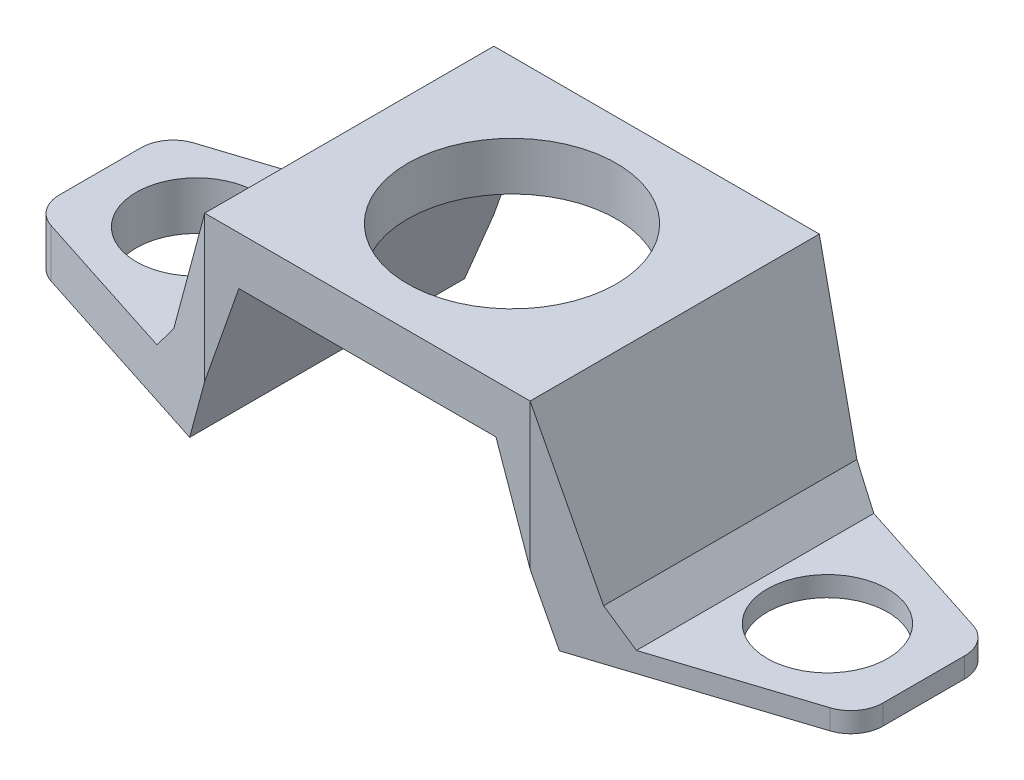
ISO-10303-21;
HEADER;
FILE_DESCRIPTION(('STEP AP214'),'2;1');
FILE_NAME('part.step','',(''),(''),'','','');
FILE_SCHEMA(('AUTOMOTIVE_DESIGN { 1 0 10303 214 1 1 1 1 }'));
ENDSEC;
DATA;
#1=APPLICATION_CONTEXT('core data for automotive mechanical design processes');
#2=APPLICATION_PROTOCOL_DEFINITION('international standard','automotive_design',2000,#1);
#3=PRODUCT_CONTEXT('',#1,'mechanical');
#4=PRODUCT('Part','Part','',(#3));
#5=PRODUCT_RELATED_PRODUCT_CATEGORY('part','',(#4));
#6=PRODUCT_DEFINITION_FORMATION('','',#4);
#7=PRODUCT_DEFINITION_CONTEXT('part definition',#1,'design');
#8=PRODUCT_DEFINITION('design','',#6,#7);
#9=PRODUCT_DEFINITION_SHAPE('','',#8);
#10=(LENGTH_UNIT() NAMED_UNIT(*) SI_UNIT(.MILLI.,.METRE.));
#11=(NAMED_UNIT(*) PLANE_ANGLE_UNIT() SI_UNIT($,.RADIAN.));
#12=(NAMED_UNIT(*) SI_UNIT($,.STERADIAN.) SOLID_ANGLE_UNIT());
#13=UNCERTAINTY_MEASURE_WITH_UNIT(LENGTH_MEASURE(1.E-05),#10,'distance_accuracy_value','');
#14=(GEOMETRIC_REPRESENTATION_CONTEXT(3) GLOBAL_UNCERTAINTY_ASSIGNED_CONTEXT((#13)) GLOBAL_UNIT_ASSIGNED_CONTEXT((#10,
#11,#12)) REPRESENTATION_CONTEXT('',''));
#15=CARTESIAN_POINT('',(0.,0.,0.));
#16=DIRECTION('',(0.,0.,1.));
#17=DIRECTION('',(1.,0.,0.));
#18=AXIS2_PLACEMENT_3D('',#15,#16,#17);
#19=CARTESIAN_POINT('',(-25.6335765484451,3.,9.));
#20=DIRECTION('',(1.,0.,0.));
#21=DIRECTION('',(0.,0.,-1.));
#22=AXIS2_PLACEMENT_3D('',#19,#20,#21);
#23=PLANE('',#22);
#24=DIRECTION('',(0.,0.,-1.));
#25=VECTOR('',#24,1.);
#26=CARTESIAN_POINT('',(-25.6335765484451,3.,9.));
#27=LINE('',#26,#25);
#28=CARTESIAN_POINT('',(-25.6335765484451,3.,2.54349252311762));
#29=VERTEX_POINT('',#28);
#30=CARTESIAN_POINT('',(-25.6335765484451,3.,-2.54349252311763));
#31=VERTEX_POINT('',#30);
#32=EDGE_CURVE('E210',#29,#31,#27,.T.);
#33=ORIENTED_EDGE('',*,*,#32,.T.);
#34=DIRECTION('',(0.,1.,0.));
#35=VECTOR('',#34,1.);
#36=CARTESIAN_POINT('',(-25.6335765484451,3.,-2.54349252311763));
#37=LINE('',#36,#35);
#38=CARTESIAN_POINT('',(-25.6335765484451,0.,-2.54349252311763));
#39=VERTEX_POINT('',#38);
#40=EDGE_CURVE('E291',#31,#39,#37,.F.);
#41=ORIENTED_EDGE('',*,*,#40,.T.);
#42=DIRECTION('',(0.,0.,-1.));
#43=VECTOR('',#42,1.);
#44=CARTESIAN_POINT('',(-25.6335765484451,0.,9.));
#45=LINE('',#44,#43);
#46=CARTESIAN_POINT('',(-25.6335765484451,0.,2.54349252311762));
#47=VERTEX_POINT('',#46);
#48=EDGE_CURVE('E247',#47,#39,#45,.T.);
#49=ORIENTED_EDGE('',*,*,#48,.F.);
#50=DIRECTION('',(0.,1.,0.));
#51=VECTOR('',#50,1.);
#52=CARTESIAN_POINT('',(-25.6335765484451,3.,2.54349252311762));
#53=LINE('',#52,#51);
#54=EDGE_CURVE('E288',#47,#29,#53,.T.);
#55=ORIENTED_EDGE('',*,*,#54,.T.);
#56=EDGE_LOOP('',(#33,#41,#49,#55));
#57=FACE_BOUND('',#56,.T.);
#58=ADVANCED_FACE('F44',(#57),#23,.F.);
#59=CARTESIAN_POINT('',(-25.6335765484451,0.,9.));
#60=DIRECTION('',(0.,1.,0.));
#61=DIRECTION('',(-1.,0.,0.));
#62=AXIS2_PLACEMENT_3D('',#59,#60,#61);
#63=PLANE('',#62);
#64=CARTESIAN_POINT('',(-19.6335765484451,0.,0.));
#65=DIRECTION('',(0.,1.,0.));
#66=DIRECTION('',(-1.,0.,0.));
#67=AXIS2_PLACEMENT_3D('',#64,#65,#66);
#68=CIRCLE('',#67,3.75);
#69=CARTESIAN_POINT('',(-19.6335765484451,0.,3.75));
#70=VERTEX_POINT('',#69);
#71=EDGE_CURVE('E333',#70,#70,#68,.F.);
#72=ORIENTED_EDGE('',*,*,#71,.F.);
#73=EDGE_LOOP('',(#72));
#74=FACE_BOUND('',#73,.T.);
#75=ORIENTED_EDGE('',*,*,#48,.T.);
#76=CARTESIAN_POINT('',(-23.6335765484451,0.,-2.54349252311763));
#77=DIRECTION('',(0.,1.,0.));
#78=DIRECTION('',(-1.,0.,0.));
#79=AXIS2_PLACEMENT_3D('',#76,#77,#78);
#80=CIRCLE('',#79,2.);
#81=CARTESIAN_POINT('',(-24.2473517188595,0.,-4.44698406241662));
#82=VERTEX_POINT('',#81);
#83=EDGE_CURVE('E295',#39,#82,#80,.F.);
#84=ORIENTED_EDGE('',*,*,#83,.T.);
#85=DIRECTION('',(0.951745769649497,0.,-0.306887585207168));
#86=VECTOR('',#85,1.);
#87=CARTESIAN_POINT('',(-29.4306030411705,0.,-2.77566013059427));
#88=LINE('',#87,#86);
#89=CARTESIAN_POINT('',(-11.5064234515549,0.,-8.55525838728262));
#90=VERTEX_POINT('',#89);
#91=EDGE_CURVE('E365',#82,#90,#88,.T.);
#92=ORIENTED_EDGE('',*,*,#91,.T.);
#93=DIRECTION('',(0.,0.,-1.));
#94=VECTOR('',#93,1.);
#95=CARTESIAN_POINT('',(-11.5064234515549,0.,9.));
#96=LINE('',#95,#94);
#97=CARTESIAN_POINT('',(-11.5064234515549,0.,8.55525838728262));
#98=VERTEX_POINT('',#97);
#99=EDGE_CURVE('E244',#98,#90,#96,.T.);
#100=ORIENTED_EDGE('',*,*,#99,.F.);
#101=DIRECTION('',(-0.951745769649497,0.,-0.306887585207168));
#102=VECTOR('',#101,1.);
#103=CARTESIAN_POINT('',(-24.1731817435508,0.,4.47089994977144));
#104=LINE('',#103,#102);
#105=CARTESIAN_POINT('',(-24.2473517188595,0.,4.44698406241662));
#106=VERTEX_POINT('',#105);
#107=EDGE_CURVE('E355',#98,#106,#104,.T.);
#108=ORIENTED_EDGE('',*,*,#107,.T.);
#109=CARTESIAN_POINT('',(-23.6335765484451,0.,2.54349252311762));
#110=DIRECTION('',(0.,1.,0.));
#111=DIRECTION('',(-1.,0.,0.));
#112=AXIS2_PLACEMENT_3D('',#109,#110,#111);
#113=CIRCLE('',#112,2.);
#114=EDGE_CURVE('E293',#106,#47,#113,.F.);
#115=ORIENTED_EDGE('',*,*,#114,.T.);
#116=EDGE_LOOP('',(#75,#84,#92,#100,#108,#115));
#117=FACE_BOUND('',#116,.T.);
#118=ADVANCED_FACE('F433',(#74,#117),#63,.F.);
#119=CARTESIAN_POINT('',(-11.5064234515549,0.,9.));
#120=DIRECTION('',(-0.943669198352679,0.330890380761382,0.));
#121=DIRECTION('',(-0.330890380761382,-0.943669198352679,0.));
#122=AXIS2_PLACEMENT_3D('',#119,#120,#121);
#123=PLANE('',#122);
#124=DIRECTION('',(0.330890380761382,0.943669198352679,0.));
#125=VECTOR('',#124,1.);
#126=CARTESIAN_POINT('',(-11.5064234515549,0.,9.));
#127=LINE('',#126,#125);
#128=CARTESIAN_POINT('',(-10.1271530968902,3.93355330216324,9.));
#129=VERTEX_POINT('',#128);
#130=CARTESIAN_POINT('',(-8.,10.,9.));
#131=VERTEX_POINT('',#130);
#132=EDGE_CURVE('E212',#129,#131,#127,.T.);
#133=ORIENTED_EDGE('',*,*,#132,.F.);
#134=DIRECTION('',(-0.329022924471758,-0.93834338327237,-0.106092460811382));
#135=VECTOR('',#134,1.);
#136=CARTESIAN_POINT('',(-11.4908989220258,0.0442745428314058,8.56026422553333));
#137=LINE('',#136,#135);
#138=EDGE_CURVE('E352',#129,#98,#137,.T.);
#139=ORIENTED_EDGE('',*,*,#138,.T.);
#140=ORIENTED_EDGE('',*,*,#99,.T.);
#141=DIRECTION('',(0.329022924471758,0.93834338327237,-0.106092460811382));
#142=VECTOR('',#141,1.);
#143=CARTESIAN_POINT('',(-12.119222252996,-1.74764631228258,-8.35766324119506));
#144=LINE('',#143,#142);
#145=CARTESIAN_POINT('',(-10.1271530968903,3.93355330216319,-9.));
#146=VERTEX_POINT('',#145);
#147=EDGE_CURVE('E362',#90,#146,#144,.T.);
#148=ORIENTED_EDGE('',*,*,#147,.T.);
#149=DIRECTION('',(0.330890380761382,0.943669198352679,0.));
#150=VECTOR('',#149,1.);
#151=CARTESIAN_POINT('',(-11.5064234515549,0.,-9.));
#152=LINE('',#151,#150);
#153=CARTESIAN_POINT('',(-8.,10.,-9.));
#154=VERTEX_POINT('',#153);
#155=EDGE_CURVE('E216',#146,#154,#152,.T.);
#156=ORIENTED_EDGE('',*,*,#155,.T.);
#157=DIRECTION('',(0.,0.,-1.));
#158=VECTOR('',#157,1.);
#159=CARTESIAN_POINT('',(-8.,10.,9.));
#160=LINE('',#159,#158);
#161=EDGE_CURVE('E241',#131,#154,#160,.T.);
#162=ORIENTED_EDGE('',*,*,#161,.F.);
#163=EDGE_LOOP('',(#133,#139,#140,#148,#156,#162));
#164=FACE_BOUND('',#163,.T.);
#165=ADVANCED_FACE('F375',(#164),#123,.F.);
#166=CARTESIAN_POINT('',(8.,9.99999999999999,9.));
#167=DIRECTION('',(0.,1.,0.));
#168=DIRECTION('',(0.,0.,1.));
#169=AXIS2_PLACEMENT_3D('',#166,#167,#168);
#170=PLANE('',#169);
#171=CARTESIAN_POINT('',(0.,9.99999999999999,0.));
#172=DIRECTION('',(0.,1.,0.));
#173=DIRECTION('',(0.,0.,1.));
#174=AXIS2_PLACEMENT_3D('',#171,#172,#173);
#175=CIRCLE('',#174,6.5);
#176=CARTESIAN_POINT('',(0.,9.99999999999999,6.5));
#177=VERTEX_POINT('',#176);
#178=EDGE_CURVE('E219',#177,#177,#175,.F.);
#179=ORIENTED_EDGE('',*,*,#178,.F.);
#180=EDGE_LOOP('',(#179));
#181=FACE_BOUND('',#180,.T.);
#182=DIRECTION('',(1.,0.,0.));
#183=VECTOR('',#182,1.);
#184=CARTESIAN_POINT('',(8.,9.99999999999999,-9.));
#185=LINE('',#184,#183);
#186=CARTESIAN_POINT('',(8.,9.99999999999999,-9.));
#187=VERTEX_POINT('',#186);
#188=EDGE_CURVE('E218',#154,#187,#185,.T.);
#189=ORIENTED_EDGE('',*,*,#188,.T.);
#190=DIRECTION('',(0.,0.,-1.));
#191=VECTOR('',#190,1.);
#192=CARTESIAN_POINT('',(8.,9.99999999999999,9.));
#193=LINE('',#192,#191);
#194=CARTESIAN_POINT('',(8.,9.99999999999999,9.));
#195=VERTEX_POINT('',#194);
#196=EDGE_CURVE('E239',#195,#187,#193,.T.);
#197=ORIENTED_EDGE('',*,*,#196,.F.);
#198=DIRECTION('',(1.,0.,0.));
#199=VECTOR('',#198,1.);
#200=CARTESIAN_POINT('',(-8.,10.,9.));
#201=LINE('',#200,#199);
#202=EDGE_CURVE('E206',#131,#195,#201,.T.);
#203=ORIENTED_EDGE('',*,*,#202,.F.);
#204=ORIENTED_EDGE('',*,*,#161,.T.);
#205=EDGE_LOOP('',(#189,#197,#203,#204));
#206=FACE_BOUND('',#205,.T.);
#207=ADVANCED_FACE('F379',(#181,#206),#170,.F.);
#208=CARTESIAN_POINT('',(11.5064234515549,0.,9.));
#209=DIRECTION('',(0.943669198352679,0.330890380761383,0.));
#210=DIRECTION('',(-0.330890380761383,0.943669198352679,0.));
#211=AXIS2_PLACEMENT_3D('',#208,#209,#210);
#212=PLANE('',#211);
#213=DIRECTION('',(0.,0.,-1.));
#214=VECTOR('',#213,1.);
#215=CARTESIAN_POINT('',(11.5064234515549,0.,9.));
#216=LINE('',#215,#214);
#217=CARTESIAN_POINT('',(11.5064234515549,0.,8.55525838728262));
#218=VERTEX_POINT('',#217);
#219=CARTESIAN_POINT('',(11.5064234515549,0.,-8.55525838728262));
#220=VERTEX_POINT('',#219);
#221=EDGE_CURVE('E200',#218,#220,#216,.T.);
#222=ORIENTED_EDGE('',*,*,#221,.F.);
#223=DIRECTION('',(-0.329022924471759,0.938343383272369,0.106092460811383));
#224=VECTOR('',#223,1.);
#225=CARTESIAN_POINT('',(11.4908989220258,0.044274542831406,8.56026422553333));
#226=LINE('',#225,#224);
#227=CARTESIAN_POINT('',(10.1271530968903,3.93355330216322,9.));
#228=VERTEX_POINT('',#227);
#229=EDGE_CURVE('E183',#218,#228,#226,.T.);
#230=ORIENTED_EDGE('',*,*,#229,.T.);
#231=DIRECTION('',(0.330890380761383,-0.943669198352679,0.));
#232=VECTOR('',#231,1.);
#233=CARTESIAN_POINT('',(11.5064234515549,0.,9.));
#234=LINE('',#233,#232);
#235=EDGE_CURVE('E198',#195,#228,#234,.T.);
#236=ORIENTED_EDGE('',*,*,#235,.F.);
#237=ORIENTED_EDGE('',*,*,#196,.T.);
#238=DIRECTION('',(0.330890380761383,-0.943669198352679,0.));
#239=VECTOR('',#238,1.);
#240=CARTESIAN_POINT('',(11.5064234515549,0.,-9.));
#241=LINE('',#240,#239);
#242=CARTESIAN_POINT('',(10.1271530968903,3.93355330216322,-9.));
#243=VERTEX_POINT('',#242);
#244=EDGE_CURVE('E221',#187,#243,#241,.T.);
#245=ORIENTED_EDGE('',*,*,#244,.T.);
#246=DIRECTION('',(0.329022924471759,-0.938343383272369,0.106092460811383));
#247=VECTOR('',#246,1.);
#248=CARTESIAN_POINT('',(12.119222252996,-1.74764631228259,-8.35766324119506));
#249=LINE('',#248,#247);
#250=EDGE_CURVE('E345',#243,#220,#249,.T.);
#251=ORIENTED_EDGE('',*,*,#250,.T.);
#252=EDGE_LOOP('',(#222,#230,#236,#237,#245,#251));
#253=FACE_BOUND('',#252,.T.);
#254=ADVANCED_FACE('F196',(#253),#212,.F.);
#255=CARTESIAN_POINT('',(25.6335765484451,0.,9.));
#256=DIRECTION('',(0.,1.,0.));
#257=DIRECTION('',(0.,0.,1.));
#258=AXIS2_PLACEMENT_3D('',#255,#256,#257);
#259=PLANE('',#258);
#260=CARTESIAN_POINT('',(19.6335765484451,0.,0.));
#261=DIRECTION('',(0.,1.,0.));
#262=DIRECTION('',(0.,0.,1.));
#263=AXIS2_PLACEMENT_3D('',#260,#261,#262);
#264=CIRCLE('',#263,3.75);
#265=CARTESIAN_POINT('',(19.6335765484451,0.,3.75));
#266=VERTEX_POINT('',#265);
#267=EDGE_CURVE('E327',#266,#266,#264,.F.);
#268=ORIENTED_EDGE('',*,*,#267,.F.);
#269=EDGE_LOOP('',(#268));
#270=FACE_BOUND('',#269,.T.);
#271=DIRECTION('',(0.951745769649497,0.,0.306887585207168));
#272=VECTOR('',#271,1.);
#273=CARTESIAN_POINT('',(29.4306030411705,0.,-2.77566013059427));
#274=LINE('',#273,#272);
#275=CARTESIAN_POINT('',(24.2473517188595,0.,-4.44698406241662));
#276=VERTEX_POINT('',#275);
#277=EDGE_CURVE('E342',#220,#276,#274,.T.);
#278=ORIENTED_EDGE('',*,*,#277,.T.);
#279=CARTESIAN_POINT('',(23.6335765484451,0.,-2.54349252311763));
#280=DIRECTION('',(0.,1.,0.));
#281=DIRECTION('',(0.,0.,1.));
#282=AXIS2_PLACEMENT_3D('',#279,#280,#281);
#283=CIRCLE('',#282,2.);
#284=CARTESIAN_POINT('',(25.6335765484451,0.,-2.54349252311763));
#285=VERTEX_POINT('',#284);
#286=EDGE_CURVE('E276',#276,#285,#283,.F.);
#287=ORIENTED_EDGE('',*,*,#286,.T.);
#288=DIRECTION('',(0.,0.,-1.));
#289=VECTOR('',#288,1.);
#290=CARTESIAN_POINT('',(25.6335765484451,0.,9.));
#291=LINE('',#290,#289);
#292=CARTESIAN_POINT('',(25.6335765484451,0.,2.54349252311763));
#293=VERTEX_POINT('',#292);
#294=EDGE_CURVE('E235',#293,#285,#291,.T.);
#295=ORIENTED_EDGE('',*,*,#294,.F.);
#296=CARTESIAN_POINT('',(23.6335765484451,0.,2.54349252311763));
#297=DIRECTION('',(0.,1.,0.));
#298=DIRECTION('',(0.,0.,1.));
#299=AXIS2_PLACEMENT_3D('',#296,#297,#298);
#300=CIRCLE('',#299,2.);
#301=CARTESIAN_POINT('',(24.2473517188595,0.,4.44698406241662));
#302=VERTEX_POINT('',#301);
#303=EDGE_CURVE('E274',#293,#302,#300,.F.);
#304=ORIENTED_EDGE('',*,*,#303,.T.);
#305=DIRECTION('',(-0.951745769649497,0.,0.306887585207168));
#306=VECTOR('',#305,1.);
#307=CARTESIAN_POINT('',(24.1731817435508,0.,4.47089994977144));
#308=LINE('',#307,#306);
#309=EDGE_CURVE('E202',#302,#218,#308,.T.);
#310=ORIENTED_EDGE('',*,*,#309,.T.);
#311=ORIENTED_EDGE('',*,*,#221,.T.);
#312=EDGE_LOOP('',(#278,#287,#295,#304,#310,#311));
#313=FACE_BOUND('',#312,.T.);
#314=ADVANCED_FACE('F387',(#270,#313),#259,.F.);
#315=CARTESIAN_POINT('',(25.6335765484451,3.,9.));
#316=DIRECTION('',(-1.,0.,0.));
#317=DIRECTION('',(0.,-1.,0.));
#318=AXIS2_PLACEMENT_3D('',#315,#316,#317);
#319=PLANE('',#318);
#320=ORIENTED_EDGE('',*,*,#294,.T.);
#321=DIRECTION('',(0.,1.,0.));
#322=VECTOR('',#321,1.);
#323=CARTESIAN_POINT('',(25.6335765484451,2.99999999999999,-2.54349252311763));
#324=LINE('',#323,#322);
#325=CARTESIAN_POINT('',(25.6335765484451,1.25,-2.54349252311763));
#326=VERTEX_POINT('',#325);
#327=EDGE_CURVE('E264',#285,#326,#324,.T.);
#328=ORIENTED_EDGE('',*,*,#327,.T.);
#329=DIRECTION('',(0.,0.,1.));
#330=VECTOR('',#329,1.);
#331=CARTESIAN_POINT('',(25.6335765484451,1.25,-10.));
#332=LINE('',#331,#330);
#333=CARTESIAN_POINT('',(25.6335765484451,1.25,2.54349252311763));
#334=VERTEX_POINT('',#333);
#335=EDGE_CURVE('E262',#326,#334,#332,.T.);
#336=ORIENTED_EDGE('',*,*,#335,.T.);
#337=DIRECTION('',(0.,1.,0.));
#338=VECTOR('',#337,1.);
#339=CARTESIAN_POINT('',(25.6335765484451,3.,2.54349252311763));
#340=LINE('',#339,#338);
#341=EDGE_CURVE('E191',#334,#293,#340,.F.);
#342=ORIENTED_EDGE('',*,*,#341,.T.);
#343=EDGE_LOOP('',(#320,#328,#336,#342));
#344=FACE_BOUND('',#343,.T.);
#345=ADVANCED_FACE('F394',(#344),#319,.F.);
#346=CARTESIAN_POINT('',(13.6335765484451,3.,9.));
#347=DIRECTION('',(-0.943669198352679,-0.330890380761383,0.));
#348=DIRECTION('',(0.330890380761383,-0.943669198352679,0.));
#349=AXIS2_PLACEMENT_3D('',#346,#347,#348);
#350=PLANE('',#349);
#351=DIRECTION('',(0.329022924471759,-0.938343383272369,-0.106092460811383));
#352=VECTOR('',#351,1.);
#353=CARTESIAN_POINT('',(13.5941096127345,3.11255610241015,7.88209021033261));
#354=LINE('',#353,#352);
#355=CARTESIAN_POINT('',(10.1271530968903,13.,9.));
#356=VERTEX_POINT('',#355);
#357=CARTESIAN_POINT('',(13.5854198909445,3.13733839670535,7.88489218521004));
#358=VERTEX_POINT('',#357);
#359=EDGE_CURVE('E186',#356,#358,#354,.T.);
#360=ORIENTED_EDGE('',*,*,#359,.T.);
#361=DIRECTION('',(0.,0.,-1.));
#362=VECTOR('',#361,1.);
#363=CARTESIAN_POINT('',(13.5854198909445,3.13733839670535,-7.67150295216404));
#364=LINE('',#363,#362);
#365=CARTESIAN_POINT('',(13.5854198909445,3.13733839670535,-7.88489218521004));
#366=VERTEX_POINT('',#365);
#367=EDGE_CURVE('E302',#358,#366,#364,.T.);
#368=ORIENTED_EDGE('',*,*,#367,.T.);
#369=DIRECTION('',(-0.329022924471759,0.938343383272369,-0.106092460811383));
#370=VECTOR('',#369,1.);
#371=CARTESIAN_POINT('',(14.2224329437047,1.32063524729615,-7.67948922599434));
#372=LINE('',#371,#370);
#373=CARTESIAN_POINT('',(10.1271530968903,13.,-9.));
#374=VERTEX_POINT('',#373);
#375=EDGE_CURVE('E201',#366,#374,#372,.T.);
#376=ORIENTED_EDGE('',*,*,#375,.T.);
#377=DIRECTION('',(0.,0.,-1.));
#378=VECTOR('',#377,1.);
#379=CARTESIAN_POINT('',(10.1271530968903,13.,9.));
#380=LINE('',#379,#378);
#381=EDGE_CURVE('E232',#356,#374,#380,.T.);
#382=ORIENTED_EDGE('',*,*,#381,.F.);
#383=EDGE_LOOP('',(#360,#368,#376,#382));
#384=FACE_BOUND('',#383,.T.);
#385=ADVANCED_FACE('F331',(#384),#350,.F.);
#386=CARTESIAN_POINT('',(-10.1271530968903,13.,9.));
#387=DIRECTION('',(0.,-1.,0.));
#388=DIRECTION('',(1.,0.,0.));
#389=AXIS2_PLACEMENT_3D('',#386,#387,#388);
#390=PLANE('',#389);
#391=CARTESIAN_POINT('',(0.,13.,0.));
#392=DIRECTION('',(0.,1.,0.));
#393=DIRECTION('',(-1.,0.,0.));
#394=AXIS2_PLACEMENT_3D('',#391,#392,#393);
#395=CIRCLE('',#394,6.5);
#396=CARTESIAN_POINT('',(-6.49999999999999,13.,0.));
#397=VERTEX_POINT('',#396);
#398=EDGE_CURVE('E367',#397,#397,#395,.T.);
#399=ORIENTED_EDGE('',*,*,#398,.F.);
#400=EDGE_LOOP('',(#399));
#401=FACE_BOUND('',#400,.T.);
#402=DIRECTION('',(-1.,0.,0.));
#403=VECTOR('',#402,1.);
#404=CARTESIAN_POINT('',(-10.1271530968903,13.,-9.));
#405=LINE('',#404,#403);
#406=CARTESIAN_POINT('',(-10.1271530968903,13.,-9.));
#407=VERTEX_POINT('',#406);
#408=EDGE_CURVE('E224',#374,#407,#405,.T.);
#409=ORIENTED_EDGE('',*,*,#408,.T.);
#410=DIRECTION('',(0.,0.,-1.));
#411=VECTOR('',#410,1.);
#412=CARTESIAN_POINT('',(-10.1271530968903,13.,9.));
#413=LINE('',#412,#411);
#414=CARTESIAN_POINT('',(-10.1271530968902,13.,9.));
#415=VERTEX_POINT('',#414);
#416=EDGE_CURVE('E229',#415,#407,#413,.T.);
#417=ORIENTED_EDGE('',*,*,#416,.F.);
#418=DIRECTION('',(-1.,0.,0.));
#419=VECTOR('',#418,1.);
#420=CARTESIAN_POINT('',(10.1271530968903,13.,9.));
#421=LINE('',#420,#419);
#422=EDGE_CURVE('E208',#356,#415,#421,.T.);
#423=ORIENTED_EDGE('',*,*,#422,.F.);
#424=ORIENTED_EDGE('',*,*,#381,.T.);
#425=EDGE_LOOP('',(#409,#417,#423,#424));
#426=FACE_BOUND('',#425,.T.);
#427=ADVANCED_FACE('F421',(#401,#426),#390,.F.);
#428=CARTESIAN_POINT('',(-13.6335765484451,3.,9.));
#429=DIRECTION('',(0.943669198352679,-0.330890380761382,0.));
#430=DIRECTION('',(0.330890380761383,0.943669198352679,0.));
#431=AXIS2_PLACEMENT_3D('',#428,#429,#430);
#432=PLANE('',#431);
#433=DIRECTION('',(-0.329022924471758,-0.93834338327237,0.106092460811382));
#434=VECTOR('',#433,1.);
#435=CARTESIAN_POINT('',(-14.2224329437047,1.32063524729616,-7.67948922599435));
#436=LINE('',#435,#434);
#437=CARTESIAN_POINT('',(-12.9717957869224,4.88733839670532,-8.08275344765369));
#438=VERTEX_POINT('',#437);
#439=EDGE_CURVE('E360',#407,#438,#436,.T.);
#440=ORIENTED_EDGE('',*,*,#439,.T.);
#441=DIRECTION('',(0.,0.,1.));
#442=VECTOR('',#441,1.);
#443=CARTESIAN_POINT('',(-12.9717957869224,4.88733839670532,7.86936421460769));
#444=LINE('',#443,#442);
#445=CARTESIAN_POINT('',(-12.9717957869224,4.88733839670532,8.08275344765369));
#446=VERTEX_POINT('',#445);
#447=EDGE_CURVE('E65',#438,#446,#444,.T.);
#448=ORIENTED_EDGE('',*,*,#447,.T.);
#449=DIRECTION('',(0.329022924471758,0.938343383272369,0.106092460811382));
#450=VECTOR('',#449,1.);
#451=CARTESIAN_POINT('',(-13.5941096127345,3.11255610241015,7.88209021033261));
#452=LINE('',#451,#450);
#453=EDGE_CURVE('E350',#446,#415,#452,.T.);
#454=ORIENTED_EDGE('',*,*,#453,.T.);
#455=ORIENTED_EDGE('',*,*,#416,.T.);
#456=EDGE_LOOP('',(#440,#448,#454,#455));
#457=FACE_BOUND('',#456,.T.);
#458=ADVANCED_FACE('F409',(#457),#432,.F.);
#459=CARTESIAN_POINT('',(-25.6335765484451,3.,9.));
#460=DIRECTION('',(0.,-1.,0.));
#461=DIRECTION('',(0.,0.,-1.));
#462=AXIS2_PLACEMENT_3D('',#459,#460,#461);
#463=PLANE('',#462);
#464=CARTESIAN_POINT('',(-19.6335765484451,3.,0.));
#465=DIRECTION('',(0.,1.,0.));
#466=DIRECTION('',(0.,0.,1.));
#467=AXIS2_PLACEMENT_3D('',#464,#465,#466);
#468=CIRCLE('',#467,3.75);
#469=CARTESIAN_POINT('',(-19.6335765484451,3.,3.75));
#470=VERTEX_POINT('',#469);
#471=EDGE_CURVE('E337',#470,#470,#468,.T.);
#472=ORIENTED_EDGE('',*,*,#471,.F.);
#473=EDGE_LOOP('',(#472));
#474=FACE_BOUND('',#473,.T.);
#475=DIRECTION('',(0.951745769649497,0.,0.306887585207168));
#476=VECTOR('',#475,1.);
#477=CARTESIAN_POINT('',(-24.1731817435508,3.,4.47089994977143));
#478=LINE('',#477,#476);
#479=CARTESIAN_POINT('',(-24.2473517188595,3.,4.44698406241662));
#480=VERTEX_POINT('',#479);
#481=CARTESIAN_POINT('',(-14.517820432236,3.,7.58424241119718));
#482=VERTEX_POINT('',#481);
#483=EDGE_CURVE('E347',#480,#482,#478,.T.);
#484=ORIENTED_EDGE('',*,*,#483,.T.);
#485=DIRECTION('',(0.,0.,-1.));
#486=VECTOR('',#485,1.);
#487=CARTESIAN_POINT('',(-14.517820432236,3.,-7.8693642146077));
#488=LINE('',#487,#486);
#489=CARTESIAN_POINT('',(-14.517820432236,3.,-7.58424241119718));
#490=VERTEX_POINT('',#489);
#491=EDGE_CURVE('E304',#482,#490,#488,.T.);
#492=ORIENTED_EDGE('',*,*,#491,.T.);
#493=DIRECTION('',(-0.951745769649497,0.,0.306887585207168));
#494=VECTOR('',#493,1.);
#495=CARTESIAN_POINT('',(-29.4306030411705,3.,-2.77566013059427));
#496=LINE('',#495,#494);
#497=CARTESIAN_POINT('',(-24.2473517188595,3.,-4.44698406241662));
#498=VERTEX_POINT('',#497);
#499=EDGE_CURVE('E358',#490,#498,#496,.T.);
#500=ORIENTED_EDGE('',*,*,#499,.T.);
#501=CARTESIAN_POINT('',(-23.6335765484451,3.,-2.54349252311763));
#502=DIRECTION('',(0.,-1.,0.));
#503=DIRECTION('',(0.,0.,-1.));
#504=AXIS2_PLACEMENT_3D('',#501,#502,#503);
#505=CIRCLE('',#504,2.);
#506=EDGE_CURVE('E286',#498,#31,#505,.F.);
#507=ORIENTED_EDGE('',*,*,#506,.T.);
#508=ORIENTED_EDGE('',*,*,#32,.F.);
#509=CARTESIAN_POINT('',(-23.6335765484451,3.,2.54349252311762));
#510=DIRECTION('',(0.,-1.,0.));
#511=DIRECTION('',(0.,0.,-1.));
#512=AXIS2_PLACEMENT_3D('',#509,#510,#511);
#513=CIRCLE('',#512,2.);
#514=EDGE_CURVE('E284',#29,#480,#513,.F.);
#515=ORIENTED_EDGE('',*,*,#514,.T.);
#516=EDGE_LOOP('',(#484,#492,#500,#507,#508,#515));
#517=FACE_BOUND('',#516,.T.);
#518=ADVANCED_FACE('F406',(#474,#517),#463,.F.);
#519=CARTESIAN_POINT('',(0.,0.,9.));
#520=DIRECTION('',(0.,0.,1.));
#521=DIRECTION('',(1.,0.,0.));
#522=AXIS2_PLACEMENT_3D('',#519,#520,#521);
#523=PLANE('',#522);
#524=DIRECTION('',(0.,-1.,0.));
#525=VECTOR('',#524,1.);
#526=CARTESIAN_POINT('',(10.1271530968903,0.,9.));
#527=LINE('',#526,#525);
#528=EDGE_CURVE('E179',#356,#228,#527,.T.);
#529=ORIENTED_EDGE('',*,*,#528,.F.);
#530=ORIENTED_EDGE('',*,*,#422,.T.);
#531=DIRECTION('',(0.,1.,0.));
#532=VECTOR('',#531,1.);
#533=CARTESIAN_POINT('',(-10.1271530968902,0.,9.));
#534=LINE('',#533,#532);
#535=EDGE_CURVE('E253',#129,#415,#534,.T.);
#536=ORIENTED_EDGE('',*,*,#535,.F.);
#537=ORIENTED_EDGE('',*,*,#132,.T.);
#538=ORIENTED_EDGE('',*,*,#202,.T.);
#539=ORIENTED_EDGE('',*,*,#235,.T.);
#540=EDGE_LOOP('',(#529,#530,#536,#537,#538,#539));
#541=FACE_BOUND('',#540,.T.);
#542=ADVANCED_FACE('F204',(#541),#523,.T.);
#543=CARTESIAN_POINT('',(0.,0.,-9.));
#544=DIRECTION('',(0.,0.,1.));
#545=DIRECTION('',(1.,0.,0.));
#546=AXIS2_PLACEMENT_3D('',#543,#544,#545);
#547=PLANE('',#546);
#548=ORIENTED_EDGE('',*,*,#408,.F.);
#549=DIRECTION('',(0.,-1.,0.));
#550=VECTOR('',#549,1.);
#551=CARTESIAN_POINT('',(10.1271530968903,0.,-9.));
#552=LINE('',#551,#550);
#553=EDGE_CURVE('E192',#374,#243,#552,.T.);
#554=ORIENTED_EDGE('',*,*,#553,.T.);
#555=ORIENTED_EDGE('',*,*,#244,.F.);
#556=ORIENTED_EDGE('',*,*,#188,.F.);
#557=ORIENTED_EDGE('',*,*,#155,.F.);
#558=DIRECTION('',(0.,1.,0.));
#559=VECTOR('',#558,1.);
#560=CARTESIAN_POINT('',(-10.1271530968903,0.,-9.));
#561=LINE('',#560,#559);
#562=EDGE_CURVE('E250',#146,#407,#561,.T.);
#563=ORIENTED_EDGE('',*,*,#562,.T.);
#564=EDGE_LOOP('',(#548,#554,#555,#556,#557,#563));
#565=FACE_BOUND('',#564,.T.);
#566=ADVANCED_FACE('F383',(#565),#547,.F.);
#567=CARTESIAN_POINT('',(0.,-0.00100000000001835,0.));
#568=DIRECTION('',(0.,1.,0.));
#569=DIRECTION('',(-1.,0.,0.));
#570=AXIS2_PLACEMENT_3D('',#567,#568,#569);
#571=CYLINDRICAL_SURFACE('',#570,6.5);
#572=ORIENTED_EDGE('',*,*,#398,.T.);
#573=EDGE_LOOP('',(#572));
#574=FACE_BOUND('',#573,.T.);
#575=ORIENTED_EDGE('',*,*,#178,.T.);
#576=EDGE_LOOP('',(#575));
#577=FACE_BOUND('',#576,.T.);
#578=ADVANCED_FACE('F516',(#574,#577),#571,.F.);
#579=CARTESIAN_POINT('',(-10.1271530968903,-5.,-9.));
#580=DIRECTION('',(0.306887585207168,0.,0.951745769649497));
#581=DIRECTION('',(0.951745769649497,0.,-0.306887585207168));
#582=AXIS2_PLACEMENT_3D('',#579,#580,#581);
#583=PLANE('',#582);
#584=ORIENTED_EDGE('',*,*,#91,.F.);
#585=DIRECTION('',(0.,1.,0.));
#586=VECTOR('',#585,1.);
#587=CARTESIAN_POINT('',(-24.2473517188595,-5.,-4.44698406241662));
#588=LINE('',#587,#586);
#589=EDGE_CURVE('E281',#82,#498,#588,.T.);
#590=ORIENTED_EDGE('',*,*,#589,.T.);
#591=ORIENTED_EDGE('',*,*,#499,.F.);
#592=DIRECTION('',(-0.620860803943776,-0.757927396464441,0.200194714752717));
#593=VECTOR('',#592,1.);
#594=CARTESIAN_POINT('',(-16.4139285410941,0.685290691193199,-6.97284800591027));
#595=LINE('',#594,#593);
#596=EDGE_CURVE('E52',#490,#438,#595,.F.);
#597=ORIENTED_EDGE('',*,*,#596,.T.);
#598=ORIENTED_EDGE('',*,*,#439,.F.);
#599=ORIENTED_EDGE('',*,*,#562,.F.);
#600=ORIENTED_EDGE('',*,*,#147,.F.);
#601=EDGE_LOOP('',(#584,#590,#591,#597,#598,#599,#600));
#602=FACE_BOUND('',#601,.T.);
#603=ADVANCED_FACE('F507',(#602),#583,.F.);
#604=CARTESIAN_POINT('',(-10.1271530968903,-5.,9.));
#605=DIRECTION('',(0.306887585207168,0.,-0.951745769649497));
#606=DIRECTION('',(-0.951745769649497,0.,-0.306887585207168));
#607=AXIS2_PLACEMENT_3D('',#604,#605,#606);
#608=PLANE('',#607);
#609=ORIENTED_EDGE('',*,*,#483,.F.);
#610=DIRECTION('',(0.,1.,0.));
#611=VECTOR('',#610,1.);
#612=CARTESIAN_POINT('',(-24.2473517188595,-5.,4.44698406241662));
#613=LINE('',#612,#611);
#614=EDGE_CURVE('E297',#480,#106,#613,.F.);
#615=ORIENTED_EDGE('',*,*,#614,.T.);
#616=ORIENTED_EDGE('',*,*,#107,.F.);
#617=ORIENTED_EDGE('',*,*,#138,.F.);
#618=ORIENTED_EDGE('',*,*,#535,.T.);
#619=ORIENTED_EDGE('',*,*,#453,.F.);
#620=DIRECTION('',(0.620860803943776,0.757927396464441,0.200194714752717));
#621=VECTOR('',#620,1.);
#622=CARTESIAN_POINT('',(-16.4139285410941,0.685290691193207,6.97284800591027));
#623=LINE('',#622,#621);
#624=EDGE_CURVE('E13',#446,#482,#623,.F.);
#625=ORIENTED_EDGE('',*,*,#624,.T.);
#626=EDGE_LOOP('',(#609,#615,#616,#617,#618,#619,#625));
#627=FACE_BOUND('',#626,.T.);
#628=ADVANCED_FACE('F418',(#627),#608,.F.);
#629=CARTESIAN_POINT('',(10.1271530968902,-5.00000000000001,-9.));
#630=DIRECTION('',(-0.306887585207168,0.,0.951745769649497));
#631=DIRECTION('',(0.951745769649497,0.,0.306887585207168));
#632=AXIS2_PLACEMENT_3D('',#629,#630,#631);
#633=PLANE('',#632);
#634=ORIENTED_EDGE('',*,*,#375,.F.);
#635=DIRECTION('',(-0.620860803943777,0.75792739646444,-0.200194714752718));
#636=VECTOR('',#635,1.);
#637=CARTESIAN_POINT('',(15.9429343520675,0.25935868483411,-7.12471867760257));
#638=LINE('',#637,#636);
#639=CARTESIAN_POINT('',(15.1314445362581,1.25,-7.38638114875352));
#640=VERTEX_POINT('',#639);
#641=EDGE_CURVE('E310',#366,#640,#638,.F.);
#642=ORIENTED_EDGE('',*,*,#641,.T.);
#643=DIRECTION('',(0.951745769649497,0.,0.306887585207168));
#644=VECTOR('',#643,1.);
#645=CARTESIAN_POINT('',(10.1271530968902,1.25,-9.));
#646=LINE('',#645,#644);
#647=CARTESIAN_POINT('',(24.2473517188595,1.25,-4.44698406241662));
#648=VERTEX_POINT('',#647);
#649=EDGE_CURVE('E316',#640,#648,#646,.T.);
#650=ORIENTED_EDGE('',*,*,#649,.T.);
#651=DIRECTION('',(0.,1.,0.));
#652=VECTOR('',#651,1.);
#653=CARTESIAN_POINT('',(24.2473517188595,-4.99999999999999,-4.44698406241662));
#654=LINE('',#653,#652);
#655=EDGE_CURVE('E272',#648,#276,#654,.F.);
#656=ORIENTED_EDGE('',*,*,#655,.T.);
#657=ORIENTED_EDGE('',*,*,#277,.F.);
#658=ORIENTED_EDGE('',*,*,#250,.F.);
#659=ORIENTED_EDGE('',*,*,#553,.F.);
#660=EDGE_LOOP('',(#634,#642,#650,#656,#657,#658,#659));
#661=FACE_BOUND('',#660,.T.);
#662=ADVANCED_FACE('F315',(#661),#633,.F.);
#663=CARTESIAN_POINT('',(10.1271530968902,-5.00000000000001,9.));
#664=DIRECTION('',(-0.306887585207168,0.,-0.951745769649497));
#665=DIRECTION('',(-0.951745769649497,0.,0.306887585207168));
#666=AXIS2_PLACEMENT_3D('',#663,#664,#665);
#667=PLANE('',#666);
#668=ORIENTED_EDGE('',*,*,#309,.F.);
#669=DIRECTION('',(0.,1.,0.));
#670=VECTOR('',#669,1.);
#671=CARTESIAN_POINT('',(24.2473517188595,-4.99999999999999,4.44698406241662));
#672=LINE('',#671,#670);
#673=CARTESIAN_POINT('',(24.2473517188595,1.25,4.44698406241662));
#674=VERTEX_POINT('',#673);
#675=EDGE_CURVE('E278',#302,#674,#672,.T.);
#676=ORIENTED_EDGE('',*,*,#675,.T.);
#677=DIRECTION('',(-0.951745769649497,0.,0.306887585207168));
#678=VECTOR('',#677,1.);
#679=CARTESIAN_POINT('',(10.1271530968902,1.25,9.));
#680=LINE('',#679,#678);
#681=CARTESIAN_POINT('',(15.1314445362581,1.25,7.38638114875352));
#682=VERTEX_POINT('',#681);
#683=EDGE_CURVE('E261',#674,#682,#680,.T.);
#684=ORIENTED_EDGE('',*,*,#683,.T.);
#685=DIRECTION('',(0.620860803943777,-0.75792739646444,-0.200194714752718));
#686=VECTOR('',#685,1.);
#687=CARTESIAN_POINT('',(15.9429343520675,0.25935868483411,7.12471867760257));
#688=LINE('',#687,#686);
#689=EDGE_CURVE('E308',#682,#358,#688,.F.);
#690=ORIENTED_EDGE('',*,*,#689,.T.);
#691=ORIENTED_EDGE('',*,*,#359,.F.);
#692=ORIENTED_EDGE('',*,*,#528,.T.);
#693=ORIENTED_EDGE('',*,*,#229,.F.);
#694=EDGE_LOOP('',(#668,#676,#684,#690,#691,#692,#693));
#695=FACE_BOUND('',#694,.T.);
#696=ADVANCED_FACE('F182',(#695),#667,.F.);
#697=CARTESIAN_POINT('',(-19.6335765484451,-0.00100000000000013,0.));
#698=DIRECTION('',(0.,1.,0.));
#699=DIRECTION('',(0.,0.,1.));
#700=AXIS2_PLACEMENT_3D('',#697,#698,#699);
#701=CYLINDRICAL_SURFACE('',#700,3.75);
#702=CARTESIAN_POINT('',(-19.6335765484451,3.,3.75));
#703=CARTESIAN_POINT('',(-19.6335765484451,2.96875,3.75));
#704=CARTESIAN_POINT('',(-19.6335765484451,2.9375,3.75));
#705=CARTESIAN_POINT('',(-19.6335765484451,2.875,3.75));
#706=CARTESIAN_POINT('',(-19.6335765484451,2.84375,3.75));
#707=CARTESIAN_POINT('',(-19.6335765484451,2.78125,3.75));
#708=CARTESIAN_POINT('',(-19.6335765484451,2.75,3.75));
#709=CARTESIAN_POINT('',(-19.6335765484451,2.6875,3.75));
#710=CARTESIAN_POINT('',(-19.6335765484451,2.65625,3.75));
#711=CARTESIAN_POINT('',(-19.6335765484451,2.59375,3.75));
#712=CARTESIAN_POINT('',(-19.6335765484451,2.5625,3.75));
#713=CARTESIAN_POINT('',(-19.6335765484451,2.5,3.75));
#714=CARTESIAN_POINT('',(-19.6335765484451,2.46875,3.75));
#715=CARTESIAN_POINT('',(-19.6335765484451,2.40625,3.75));
#716=CARTESIAN_POINT('',(-19.6335765484451,2.375,3.75));
#717=CARTESIAN_POINT('',(-19.6335765484451,2.3125,3.75));
#718=CARTESIAN_POINT('',(-19.6335765484451,2.28125,3.75));
#719=CARTESIAN_POINT('',(-19.6335765484451,2.21875,3.75));
#720=CARTESIAN_POINT('',(-19.6335765484451,2.1875,3.75));
#721=CARTESIAN_POINT('',(-19.6335765484451,2.125,3.75));
#722=CARTESIAN_POINT('',(-19.6335765484451,2.09375,3.75));
#723=CARTESIAN_POINT('',(-19.6335765484451,2.03125,3.75));
#724=CARTESIAN_POINT('',(-19.6335765484451,2.,3.75));
#725=CARTESIAN_POINT('',(-19.6335765484451,1.9375,3.75));
#726=CARTESIAN_POINT('',(-19.6335765484451,1.90625,3.75));
#727=CARTESIAN_POINT('',(-19.6335765484451,1.84375,3.75));
#728=CARTESIAN_POINT('',(-19.6335765484451,1.8125,3.75));
#729=CARTESIAN_POINT('',(-19.6335765484451,1.75,3.75));
#730=CARTESIAN_POINT('',(-19.6335765484451,1.71875,3.75));
#731=CARTESIAN_POINT('',(-19.6335765484451,1.65625,3.75));
#732=CARTESIAN_POINT('',(-19.6335765484451,1.625,3.75));
#733=CARTESIAN_POINT('',(-19.6335765484451,1.5625,3.75));
#734=CARTESIAN_POINT('',(-19.6335765484451,1.53125,3.75));
#735=CARTESIAN_POINT('',(-19.6335765484451,1.46875,3.75));
#736=CARTESIAN_POINT('',(-19.6335765484451,1.4375,3.75));
#737=CARTESIAN_POINT('',(-19.6335765484451,1.375,3.75));
#738=CARTESIAN_POINT('',(-19.6335765484451,1.34375,3.75));
#739=CARTESIAN_POINT('',(-19.6335765484451,1.28125,3.75));
#740=CARTESIAN_POINT('',(-19.6335765484451,1.25,3.75));
#741=CARTESIAN_POINT('',(-19.6335765484451,1.1875,3.75));
#742=CARTESIAN_POINT('',(-19.6335765484451,1.15625,3.75));
#743=CARTESIAN_POINT('',(-19.6335765484451,1.09375,3.75));
#744=CARTESIAN_POINT('',(-19.6335765484451,1.0625,3.75));
#745=CARTESIAN_POINT('',(-19.6335765484451,1.,3.75));
#746=CARTESIAN_POINT('',(-19.6335765484451,0.96875,3.75));
#747=CARTESIAN_POINT('',(-19.6335765484451,0.90625,3.75));
#748=CARTESIAN_POINT('',(-19.6335765484451,0.875,3.75));
#749=CARTESIAN_POINT('',(-19.6335765484451,0.8125,3.75));
#750=CARTESIAN_POINT('',(-19.6335765484451,0.78125,3.75));
#751=CARTESIAN_POINT('',(-19.6335765484451,0.71875,3.75));
#752=CARTESIAN_POINT('',(-19.6335765484451,0.6875,3.75));
#753=CARTESIAN_POINT('',(-19.6335765484451,0.625,3.75));
#754=CARTESIAN_POINT('',(-19.6335765484451,0.59375,3.75));
#755=CARTESIAN_POINT('',(-19.6335765484451,0.53125,3.75));
#756=CARTESIAN_POINT('',(-19.6335765484451,0.5,3.75));
#757=CARTESIAN_POINT('',(-19.6335765484451,0.4375,3.75));
#758=CARTESIAN_POINT('',(-19.6335765484451,0.40625,3.75));
#759=CARTESIAN_POINT('',(-19.6335765484451,0.34375,3.75));
#760=CARTESIAN_POINT('',(-19.6335765484451,0.3125,3.75));
#761=CARTESIAN_POINT('',(-19.6335765484451,0.25,3.75));
#762=CARTESIAN_POINT('',(-19.6335765484451,0.21875,3.75));
#763=CARTESIAN_POINT('',(-19.6335765484451,0.15625,3.75));
#764=CARTESIAN_POINT('',(-19.6335765484451,0.125,3.75));
#765=CARTESIAN_POINT('',(-19.6335765484451,0.0625000000000001,3.75));
#766=CARTESIAN_POINT('',(-19.6335765484451,0.0312500000000001,3.75));
#767=CARTESIAN_POINT('',(-19.6335765484451,0.,3.75));
#768=B_SPLINE_CURVE_WITH_KNOTS('',3,(#702,#703,#704,#705,#706,#707,#708,#709,#710,#711,#712,
#713,#714,#715,#716,#717,#718,#719,#720,#721,#722,#723,#724,#725,#726,#727,#728,#729,#730,#731,
#732,#733,#734,#735,#736,#737,#738,#739,#740,#741,#742,#743,#744,#745,#746,#747,#748,#749,#750,
#751,#752,#753,#754,#755,#756,#757,#758,#759,#760,#761,#762,#763,#764,#765,#766,#767),
.UNSPECIFIED.,.F.,.F.,(4,2,2,2,2,2,2,2,2,2,2,2,2,2,2,2,2,2,2,2,2,2,2,2,2,2,2,2,2,2,2,2,4),(0.,
0.0937500000000001,0.1875,0.28125,0.375,0.46875,0.5625,0.65625,0.75,0.84375,0.9375,1.03125,
1.125,1.21875,1.3125,1.40625,1.5,1.59375,1.6875,1.78125,1.875,1.96875,2.0625,2.15625,2.25,
2.34375,2.4375,2.53125,2.625,2.71875,2.8125,2.90625,3.),.UNSPECIFIED.);
#769=EDGE_CURVE('BSEAM403',#470,#70,#768,.T.);
#770=ORIENTED_EDGE('',*,*,#471,.T.);
#771=ORIENTED_EDGE('',*,*,#71,.T.);
#772=ORIENTED_EDGE('',*,*,#769,.T.);
#773=ORIENTED_EDGE('',*,*,#769,.F.);
#774=EDGE_LOOP('',(#770,#772,#771,#773));
#775=FACE_BOUND('',#774,.T.);
#776=ADVANCED_FACE('F403',(#775),#701,.F.);
#777=CARTESIAN_POINT('',(19.6335765484451,-0.00100000000000013,0.));
#778=DIRECTION('',(0.,1.,0.));
#779=DIRECTION('',(0.,0.,1.));
#780=AXIS2_PLACEMENT_3D('',#777,#778,#779);
#781=CYLINDRICAL_SURFACE('',#780,3.75);
#782=CARTESIAN_POINT('',(19.6335765484451,1.25,0.));
#783=DIRECTION('',(0.,-1.,0.));
#784=DIRECTION('',(0.,0.,-1.));
#785=AXIS2_PLACEMENT_3D('',#782,#783,#784);
#786=CIRCLE('',#785,3.75);
#787=CARTESIAN_POINT('',(19.6335765484451,1.25,3.75));
#788=VERTEX_POINT('',#787);
#789=EDGE_CURVE('E258',#788,#788,#786,.F.);
#790=CARTESIAN_POINT('',(19.6335765484451,1.25,3.75));
#791=CARTESIAN_POINT('',(19.6335765484451,1.23697916666667,3.75));
#792=CARTESIAN_POINT('',(19.6335765484451,1.22395833333333,3.75));
#793=CARTESIAN_POINT('',(19.6335765484451,1.19791666666667,3.75));
#794=CARTESIAN_POINT('',(19.6335765484451,1.18489583333333,3.75));
#795=CARTESIAN_POINT('',(19.6335765484451,1.15885416666667,3.75));
#796=CARTESIAN_POINT('',(19.6335765484451,1.14583333333333,3.75));
#797=CARTESIAN_POINT('',(19.6335765484451,1.11979166666667,3.75));
#798=CARTESIAN_POINT('',(19.6335765484451,1.10677083333333,3.75));
#799=CARTESIAN_POINT('',(19.6335765484451,1.08072916666667,3.75));
#800=CARTESIAN_POINT('',(19.6335765484451,1.06770833333333,3.75));
#801=CARTESIAN_POINT('',(19.6335765484451,1.04166666666667,3.75));
#802=CARTESIAN_POINT('',(19.6335765484451,1.02864583333333,3.75));
#803=CARTESIAN_POINT('',(19.6335765484451,1.00260416666667,3.75));
#804=CARTESIAN_POINT('',(19.6335765484451,0.989583333333334,3.75));
#805=CARTESIAN_POINT('',(19.6335765484451,0.963541666666667,3.75));
#806=CARTESIAN_POINT('',(19.6335765484451,0.950520833333334,3.75));
#807=CARTESIAN_POINT('',(19.6335765484451,0.924479166666667,3.75));
#808=CARTESIAN_POINT('',(19.6335765484451,0.911458333333334,3.75));
#809=CARTESIAN_POINT('',(19.6335765484451,0.885416666666667,3.75));
#810=CARTESIAN_POINT('',(19.6335765484451,0.872395833333334,3.75));
#811=CARTESIAN_POINT('',(19.6335765484451,0.846354166666667,3.75));
#812=CARTESIAN_POINT('',(19.6335765484451,0.833333333333334,3.75));
#813=CARTESIAN_POINT('',(19.6335765484451,0.807291666666667,3.75));
#814=CARTESIAN_POINT('',(19.6335765484451,0.794270833333334,3.75));
#815=CARTESIAN_POINT('',(19.6335765484451,0.768229166666667,3.75));
#816=CARTESIAN_POINT('',(19.6335765484451,0.755208333333334,3.75));
#817=CARTESIAN_POINT('',(19.6335765484451,0.729166666666667,3.75));
#818=CARTESIAN_POINT('',(19.6335765484451,0.716145833333334,3.75));
#819=CARTESIAN_POINT('',(19.6335765484451,0.690104166666667,3.75));
#820=CARTESIAN_POINT('',(19.6335765484451,0.677083333333334,3.75));
#821=CARTESIAN_POINT('',(19.6335765484451,0.651041666666667,3.75));
#822=CARTESIAN_POINT('',(19.6335765484451,0.638020833333334,3.75));
#823=CARTESIAN_POINT('',(19.6335765484451,0.611979166666667,3.75));
#824=CARTESIAN_POINT('',(19.6335765484451,0.598958333333334,3.75));
#825=CARTESIAN_POINT('',(19.6335765484451,0.572916666666667,3.75));
#826=CARTESIAN_POINT('',(19.6335765484451,0.559895833333334,3.75));
#827=CARTESIAN_POINT('',(19.6335765484451,0.533854166666667,3.75));
#828=CARTESIAN_POINT('',(19.6335765484451,0.520833333333334,3.75));
#829=CARTESIAN_POINT('',(19.6335765484451,0.494791666666667,3.75));
#830=CARTESIAN_POINT('',(19.6335765484451,0.481770833333334,3.75));
#831=CARTESIAN_POINT('',(19.6335765484451,0.455729166666667,3.75));
#832=CARTESIAN_POINT('',(19.6335765484451,0.442708333333334,3.75));
#833=CARTESIAN_POINT('',(19.6335765484451,0.416666666666667,3.75));
#834=CARTESIAN_POINT('',(19.6335765484451,0.403645833333334,3.75));
#835=CARTESIAN_POINT('',(19.6335765484451,0.377604166666667,3.75));
#836=CARTESIAN_POINT('',(19.6335765484451,0.364583333333334,3.75));
#837=CARTESIAN_POINT('',(19.6335765484451,0.338541666666667,3.75));
#838=CARTESIAN_POINT('',(19.6335765484451,0.325520833333334,3.75));
#839=CARTESIAN_POINT('',(19.6335765484451,0.299479166666667,3.75));
#840=CARTESIAN_POINT('',(19.6335765484451,0.286458333333334,3.75));
#841=CARTESIAN_POINT('',(19.6335765484451,0.260416666666667,3.75));
#842=CARTESIAN_POINT('',(19.6335765484451,0.247395833333334,3.75));
#843=CARTESIAN_POINT('',(19.6335765484451,0.221354166666667,3.75));
#844=CARTESIAN_POINT('',(19.6335765484451,0.208333333333333,3.75));
#845=CARTESIAN_POINT('',(19.6335765484451,0.182291666666667,3.75));
#846=CARTESIAN_POINT('',(19.6335765484451,0.169270833333333,3.75));
#847=CARTESIAN_POINT('',(19.6335765484451,0.143229166666667,3.75));
#848=CARTESIAN_POINT('',(19.6335765484451,0.130208333333333,3.75));
#849=CARTESIAN_POINT('',(19.6335765484451,0.104166666666667,3.75));
#850=CARTESIAN_POINT('',(19.6335765484451,0.0911458333333334,3.75));
#851=CARTESIAN_POINT('',(19.6335765484451,0.0651041666666667,3.75));
#852=CARTESIAN_POINT('',(19.6335765484451,0.0520833333333334,3.75));
#853=CARTESIAN_POINT('',(19.6335765484451,0.0260416666666667,3.75));
#854=CARTESIAN_POINT('',(19.6335765484451,0.0130208333333334,3.75));
#855=CARTESIAN_POINT('',(19.6335765484451,0.,3.75));
#856=B_SPLINE_CURVE_WITH_KNOTS('',3,(#790,#791,#792,#793,#794,#795,#796,#797,#798,#799,#800,
#801,#802,#803,#804,#805,#806,#807,#808,#809,#810,#811,#812,#813,#814,#815,#816,#817,#818,#819,
#820,#821,#822,#823,#824,#825,#826,#827,#828,#829,#830,#831,#832,#833,#834,#835,#836,#837,#838,
#839,#840,#841,#842,#843,#844,#845,#846,#847,#848,#849,#850,#851,#852,#853,#854,#855),
.UNSPECIFIED.,.F.,.F.,(4,2,2,2,2,2,2,2,2,2,2,2,2,2,2,2,2,2,2,2,2,2,2,2,2,2,2,2,2,2,2,2,4),(0.,
0.0390625,0.0781250000000001,0.1171875,0.15625,0.1953125,0.234375,0.2734375,0.3125,0.3515625,
0.390625,0.4296875,0.46875,0.5078125,0.546875,0.5859375,0.625,0.6640625,0.703125000000001,
0.742187500000001,0.78125,0.820312500000001,0.859375000000001,0.898437500000001,
0.937500000000001,0.976562500000001,1.015625,1.0546875,1.09375,1.1328125,1.171875,1.2109375,
1.25),.UNSPECIFIED.);
#857=EDGE_CURVE('BSEAM476',#788,#266,#856,.T.);
#858=ORIENTED_EDGE('',*,*,#789,.T.);
#859=ORIENTED_EDGE('',*,*,#267,.T.);
#860=ORIENTED_EDGE('',*,*,#857,.T.);
#861=ORIENTED_EDGE('',*,*,#857,.F.);
#862=EDGE_LOOP('',(#858,#860,#859,#861));
#863=FACE_BOUND('',#862,.T.);
#864=ADVANCED_FACE('F476',(#863),#781,.F.);
#865=CARTESIAN_POINT('',(14.2472006524672,1.25,-10.));
#866=DIRECTION('',(0.,-1.,0.));
#867=DIRECTION('',(0.,0.,-1.));
#868=AXIS2_PLACEMENT_3D('',#865,#866,#867);
#869=PLANE('',#868);
#870=ORIENTED_EDGE('',*,*,#789,.F.);
#871=EDGE_LOOP('',(#870));
#872=FACE_BOUND('',#871,.T.);
#873=ORIENTED_EDGE('',*,*,#649,.F.);
#874=DIRECTION('',(0.,0.,1.));
#875=VECTOR('',#874,1.);
#876=CARTESIAN_POINT('',(15.1314445362581,1.25,7.67150295216404));
#877=LINE('',#876,#875);
#878=EDGE_CURVE('E299',#640,#682,#877,.T.);
#879=ORIENTED_EDGE('',*,*,#878,.T.);
#880=ORIENTED_EDGE('',*,*,#683,.F.);
#881=CARTESIAN_POINT('',(23.6335765484451,1.25,2.54349252311763));
#882=DIRECTION('',(0.,-1.,0.));
#883=DIRECTION('',(0.,0.,-1.));
#884=AXIS2_PLACEMENT_3D('',#881,#882,#883);
#885=CIRCLE('',#884,2.);
#886=EDGE_CURVE('E267',#674,#334,#885,.F.);
#887=ORIENTED_EDGE('',*,*,#886,.T.);
#888=ORIENTED_EDGE('',*,*,#335,.F.);
#889=CARTESIAN_POINT('',(23.6335765484451,1.25,-2.54349252311763));
#890=DIRECTION('',(0.,-1.,0.));
#891=DIRECTION('',(0.,0.,-1.));
#892=AXIS2_PLACEMENT_3D('',#889,#890,#891);
#893=CIRCLE('',#892,2.);
#894=EDGE_CURVE('E269',#326,#648,#893,.F.);
#895=ORIENTED_EDGE('',*,*,#894,.T.);
#896=EDGE_LOOP('',(#873,#879,#880,#887,#888,#895));
#897=FACE_BOUND('',#896,.T.);
#898=ADVANCED_FACE('F322',(#872,#897),#869,.F.);
#899=CARTESIAN_POINT('',(23.6335765484451,2.99999999999999,-2.54349252311763));
#900=DIRECTION('',(0.,1.,0.));
#901=DIRECTION('',(-1.,0.,0.));
#902=AXIS2_PLACEMENT_3D('',#899,#900,#901);
#903=CYLINDRICAL_SURFACE('',#902,2.);
#904=ORIENTED_EDGE('',*,*,#286,.F.);
#905=ORIENTED_EDGE('',*,*,#655,.F.);
#906=ORIENTED_EDGE('',*,*,#894,.F.);
#907=ORIENTED_EDGE('',*,*,#327,.F.);
#908=EDGE_LOOP('',(#904,#905,#906,#907));
#909=FACE_BOUND('',#908,.T.);
#910=ADVANCED_FACE('F391',(#909),#903,.T.);
#911=CARTESIAN_POINT('',(23.6335765484451,-4.99999999999999,2.54349252311762));
#912=DIRECTION('',(0.,1.,0.));
#913=DIRECTION('',(-1.,0.,0.));
#914=AXIS2_PLACEMENT_3D('',#911,#912,#913);
#915=CYLINDRICAL_SURFACE('',#914,2.);
#916=ORIENTED_EDGE('',*,*,#303,.F.);
#917=ORIENTED_EDGE('',*,*,#341,.F.);
#918=ORIENTED_EDGE('',*,*,#886,.F.);
#919=ORIENTED_EDGE('',*,*,#675,.F.);
#920=EDGE_LOOP('',(#916,#917,#918,#919));
#921=FACE_BOUND('',#920,.T.);
#922=ADVANCED_FACE('F445',(#921),#915,.T.);
#923=CARTESIAN_POINT('',(-23.6335765484451,-5.,-2.54349252311763));
#924=DIRECTION('',(0.,1.,0.));
#925=DIRECTION('',(0.,0.,1.));
#926=AXIS2_PLACEMENT_3D('',#923,#924,#925);
#927=CYLINDRICAL_SURFACE('',#926,2.);
#928=ORIENTED_EDGE('',*,*,#83,.F.);
#929=ORIENTED_EDGE('',*,*,#40,.F.);
#930=ORIENTED_EDGE('',*,*,#506,.F.);
#931=ORIENTED_EDGE('',*,*,#589,.F.);
#932=EDGE_LOOP('',(#928,#929,#930,#931));
#933=FACE_BOUND('',#932,.T.);
#934=ADVANCED_FACE('F448',(#933),#927,.T.);
#935=CARTESIAN_POINT('',(-23.6335765484451,3.,2.54349252311762));
#936=DIRECTION('',(0.,1.,0.));
#937=DIRECTION('',(0.,0.,1.));
#938=AXIS2_PLACEMENT_3D('',#935,#936,#937);
#939=CYLINDRICAL_SURFACE('',#938,2.);
#940=ORIENTED_EDGE('',*,*,#114,.F.);
#941=ORIENTED_EDGE('',*,*,#614,.F.);
#942=ORIENTED_EDGE('',*,*,#514,.F.);
#943=ORIENTED_EDGE('',*,*,#54,.F.);
#944=EDGE_LOOP('',(#940,#941,#942,#943));
#945=FACE_BOUND('',#944,.T.);
#946=ADVANCED_FACE('F452',(#945),#939,.T.);
#947=CARTESIAN_POINT('',(15.1314445362581,1.25,-10.));
#948=DIRECTION('',(0.77358780670187,0.633689123563117,0.));
#949=DIRECTION('',(0.,0.,-1.));
#950=AXIS2_PLACEMENT_3D('',#947,#948,#949);
#951=PLANE('',#950);
#952=ORIENTED_EDGE('',*,*,#641,.F.);
#953=ORIENTED_EDGE('',*,*,#367,.F.);
#954=ORIENTED_EDGE('',*,*,#689,.F.);
#955=ORIENTED_EDGE('',*,*,#878,.F.);
#956=EDGE_LOOP('',(#952,#953,#954,#955));
#957=FACE_BOUND('',#956,.T.);
#958=ADVANCED_FACE('F329',(#957),#951,.T.);
#959=CARTESIAN_POINT('',(-14.517820432236,3.,9.));
#960=DIRECTION('',(-0.77358780670187,0.633689123563115,0.));
#961=DIRECTION('',(0.,0.,1.));
#962=AXIS2_PLACEMENT_3D('',#959,#960,#961);
#963=PLANE('',#962);
#964=ORIENTED_EDGE('',*,*,#624,.F.);
#965=ORIENTED_EDGE('',*,*,#447,.F.);
#966=ORIENTED_EDGE('',*,*,#596,.F.);
#967=ORIENTED_EDGE('',*,*,#491,.F.);
#968=EDGE_LOOP('',(#964,#965,#966,#967));
#969=FACE_BOUND('',#968,.T.);
#970=ADVANCED_FACE('F46',(#969),#963,.T.);
#971=CLOSED_SHELL('',(#58,#118,#165,#207,#254,#314,#345,#385,#427,#458,#518,#542,#566,#578,#603,
#628,#662,#696,#776,#864,#898,#910,#922,#934,#946,#958,#970));
#972=MANIFOLD_SOLID_BREP('B2',#971);
#973=ADVANCED_BREP_SHAPE_REPRESENTATION('',(#18,#972),#14);
#974=SHAPE_DEFINITION_REPRESENTATION(#9,#973);
ENDSEC;
END-ISO-10303-21;
